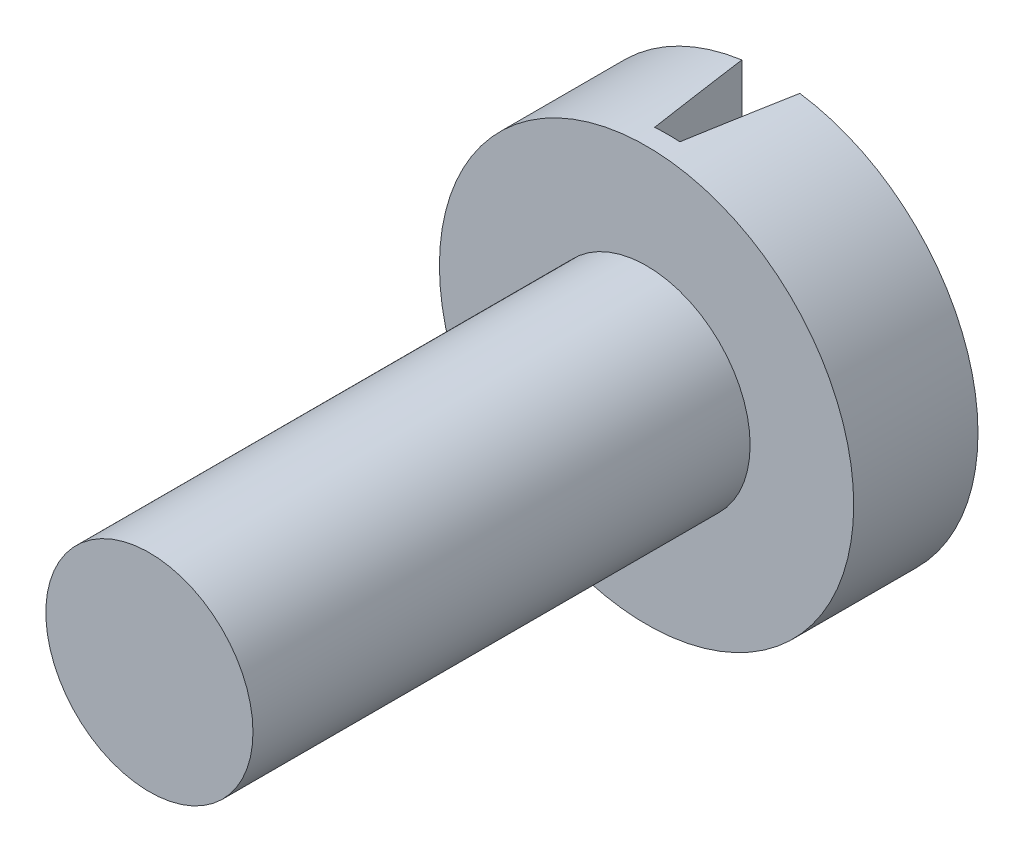
ISO-10303-21;
HEADER;
FILE_DESCRIPTION(('STEP AP214'),'2;1');
FILE_NAME('part.step','',(''),(''),'','','');
FILE_SCHEMA(('AUTOMOTIVE_DESIGN { 1 0 10303 214 1 1 1 1 }'));
ENDSEC;
DATA;
#1=APPLICATION_CONTEXT('core data for automotive mechanical design processes');
#2=APPLICATION_PROTOCOL_DEFINITION('international standard','automotive_design',2000,#1);
#3=PRODUCT_CONTEXT('',#1,'mechanical');
#4=PRODUCT('Part','Part','',(#3));
#5=PRODUCT_RELATED_PRODUCT_CATEGORY('part','',(#4));
#6=PRODUCT_DEFINITION_FORMATION('','',#4);
#7=PRODUCT_DEFINITION_CONTEXT('part definition',#1,'design');
#8=PRODUCT_DEFINITION('design','',#6,#7);
#9=PRODUCT_DEFINITION_SHAPE('','',#8);
#10=(LENGTH_UNIT() NAMED_UNIT(*) SI_UNIT(.MILLI.,.METRE.));
#11=(NAMED_UNIT(*) PLANE_ANGLE_UNIT() SI_UNIT($,.RADIAN.));
#12=(NAMED_UNIT(*) SI_UNIT($,.STERADIAN.) SOLID_ANGLE_UNIT());
#13=UNCERTAINTY_MEASURE_WITH_UNIT(LENGTH_MEASURE(1.E-05),#10,'distance_accuracy_value','');
#14=(GEOMETRIC_REPRESENTATION_CONTEXT(3) GLOBAL_UNCERTAINTY_ASSIGNED_CONTEXT((#13)) GLOBAL_UNIT_ASSIGNED_CONTEXT((#10,
#11,#12)) REPRESENTATION_CONTEXT('',''));
#15=CARTESIAN_POINT('',(0.,0.,0.));
#16=DIRECTION('',(0.,0.,1.));
#17=DIRECTION('',(1.,0.,0.));
#18=AXIS2_PLACEMENT_3D('',#15,#16,#17);
#19=CARTESIAN_POINT('',(0.,0.,-3.));
#20=DIRECTION('',(0.,0.,1.));
#21=DIRECTION('',(1.,0.,0.));
#22=AXIS2_PLACEMENT_3D('',#19,#20,#21);
#23=PLANE('',#22);
#24=CARTESIAN_POINT('',(0.,0.,-3.));
#25=DIRECTION('',(0.,0.,1.));
#26=DIRECTION('',(1.,0.,0.));
#27=AXIS2_PLACEMENT_3D('',#24,#25,#26);
#28=CIRCLE('',#27,5.);
#29=CARTESIAN_POINT('',(-0.7,4.95075751779463,-3.));
#30=VERTEX_POINT('',#29);
#31=CARTESIAN_POINT('',(-0.7,-4.95075751779463,-3.));
#32=VERTEX_POINT('',#31);
#33=EDGE_CURVE('E102',#30,#32,#28,.T.);
#34=ORIENTED_EDGE('',*,*,#33,.F.);
#35=DIRECTION('',(0.,-1.,0.));
#36=VECTOR('',#35,1.);
#37=CARTESIAN_POINT('',(-0.7,0.,-3.));
#38=LINE('',#37,#36);
#39=EDGE_CURVE('E88',#30,#32,#38,.T.);
#40=ORIENTED_EDGE('',*,*,#39,.T.);
#41=EDGE_LOOP('',(#34,#40));
#42=FACE_BOUND('',#41,.T.);
#43=ADVANCED_FACE('F39',(#42),#23,.F.);
#44=CARTESIAN_POINT('',(0.,0.,12.));
#45=DIRECTION('',(0.,0.,-1.));
#46=DIRECTION('',(-1.,0.,0.));
#47=AXIS2_PLACEMENT_3D('',#44,#45,#46);
#48=CYLINDRICAL_SURFACE('',#47,2.5);
#49=CARTESIAN_POINT('',(0.,0.,12.));
#50=DIRECTION('',(0.,0.,1.));
#51=DIRECTION('',(1.,0.,0.));
#52=AXIS2_PLACEMENT_3D('',#49,#50,#51);
#53=CIRCLE('',#52,2.5);
#54=CARTESIAN_POINT('',(2.5,0.,12.));
#55=VERTEX_POINT('',#54);
#56=EDGE_CURVE('E89',#55,#55,#53,.T.);
#57=ORIENTED_EDGE('',*,*,#56,.F.);
#58=EDGE_LOOP('',(#57));
#59=FACE_BOUND('',#58,.T.);
#60=CARTESIAN_POINT('',(0.,0.,0.));
#61=DIRECTION('',(0.,0.,1.));
#62=DIRECTION('',(1.,0.,0.));
#63=AXIS2_PLACEMENT_3D('',#60,#61,#62);
#64=CIRCLE('',#63,2.5);
#65=CARTESIAN_POINT('',(2.5,0.,0.));
#66=VERTEX_POINT('',#65);
#67=EDGE_CURVE('E108',#66,#66,#64,.T.);
#68=ORIENTED_EDGE('',*,*,#67,.T.);
#69=EDGE_LOOP('',(#68));
#70=FACE_BOUND('',#69,.T.);
#71=ADVANCED_FACE('F41',(#59,#70),#48,.T.);
#72=CARTESIAN_POINT('',(0.,0.,12.));
#73=DIRECTION('',(0.,0.,1.));
#74=DIRECTION('',(1.,0.,0.));
#75=AXIS2_PLACEMENT_3D('',#72,#73,#74);
#76=PLANE('',#75);
#77=ORIENTED_EDGE('',*,*,#56,.T.);
#78=EDGE_LOOP('',(#77));
#79=FACE_BOUND('',#78,.T.);
#80=ADVANCED_FACE('F141',(#79),#76,.T.);
#81=CARTESIAN_POINT('',(0.,0.,-3.));
#82=DIRECTION('',(0.,0.,1.));
#83=DIRECTION('',(1.,0.,0.));
#84=AXIS2_PLACEMENT_3D('',#81,#82,#83);
#85=CYLINDRICAL_SURFACE('',#84,5.);
#86=CARTESIAN_POINT('',(0.,0.,1.41962606027253));
#87=DIRECTION('',(-0.987688340595138,0.,0.156434465040231));
#88=DIRECTION('',(0.156434465040231,0.,0.987688340595138));
#89=AXIS2_PLACEMENT_3D('',#86,#87,#88);
#90=ELLIPSE('',#89,31.9622661074983,5.);
#91=CARTESIAN_POINT('',(-0.304038899188659,-4.99074747385401,-0.5));
#92=VERTEX_POINT('',#91);
#93=EDGE_CURVE('E110',#92,#32,#90,.F.);
#94=ORIENTED_EDGE('',*,*,#93,.F.);
#95=CARTESIAN_POINT('',(0.,0.,-0.5));
#96=DIRECTION('',(0.,0.,1.));
#97=DIRECTION('',(1.,0.,0.));
#98=AXIS2_PLACEMENT_3D('',#95,#96,#97);
#99=CIRCLE('',#98,5.);
#100=CARTESIAN_POINT('',(0.304038899188659,-4.99074747385401,-0.5));
#101=VERTEX_POINT('',#100);
#102=EDGE_CURVE('E11',#101,#92,#99,.F.);
#103=ORIENTED_EDGE('',*,*,#102,.F.);
#104=CARTESIAN_POINT('',(0.,0.,1.41962606027253));
#105=DIRECTION('',(0.987688340595138,0.,0.156434465040231));
#106=DIRECTION('',(-0.156434465040231,0.,0.987688340595138));
#107=AXIS2_PLACEMENT_3D('',#104,#105,#106);
#108=ELLIPSE('',#107,31.9622661074983,5.);
#109=CARTESIAN_POINT('',(0.7,-4.95075751779463,-3.));
#110=VERTEX_POINT('',#109);
#111=EDGE_CURVE('E82',#110,#101,#108,.F.);
#112=ORIENTED_EDGE('',*,*,#111,.F.);
#113=CARTESIAN_POINT('',(0.7,4.95075751779463,-3.));
#114=VERTEX_POINT('',#113);
#115=EDGE_CURVE('E96',#110,#114,#28,.T.);
#116=ORIENTED_EDGE('',*,*,#115,.T.);
#117=CARTESIAN_POINT('',(0.304038899188659,4.99074747385401,-0.5));
#118=VERTEX_POINT('',#117);
#119=EDGE_CURVE('E55',#118,#114,#108,.F.);
#120=ORIENTED_EDGE('',*,*,#119,.F.);
#121=CARTESIAN_POINT('',(-0.304038899188659,4.99074747385401,-0.5));
#122=VERTEX_POINT('',#121);
#123=EDGE_CURVE('E43',#122,#118,#99,.F.);
#124=ORIENTED_EDGE('',*,*,#123,.F.);
#125=EDGE_CURVE('E63',#30,#122,#90,.F.);
#126=ORIENTED_EDGE('',*,*,#125,.F.);
#127=ORIENTED_EDGE('',*,*,#33,.T.);
#128=EDGE_LOOP('',(#94,#103,#112,#116,#120,#124,#126,#127));
#129=FACE_BOUND('',#128,.T.);
#130=CARTESIAN_POINT('',(0.,0.,0.));
#131=DIRECTION('',(0.,0.,1.));
#132=DIRECTION('',(1.,0.,0.));
#133=AXIS2_PLACEMENT_3D('',#130,#131,#132);
#134=CIRCLE('',#133,5.);
#135=CARTESIAN_POINT('',(5.,0.,0.));
#136=VERTEX_POINT('',#135);
#137=EDGE_CURVE('E103',#136,#136,#134,.T.);
#138=ORIENTED_EDGE('',*,*,#137,.F.);
#139=EDGE_LOOP('',(#138));
#140=FACE_BOUND('',#139,.T.);
#141=ADVANCED_FACE('F94',(#129,#140),#85,.T.);
#142=ORIENTED_EDGE('',*,*,#115,.F.);
#143=DIRECTION('',(0.,1.,0.));
#144=VECTOR('',#143,1.);
#145=CARTESIAN_POINT('',(0.7,0.,-3.));
#146=LINE('',#145,#144);
#147=EDGE_CURVE('E79',#110,#114,#146,.T.);
#148=ORIENTED_EDGE('',*,*,#147,.T.);
#149=EDGE_LOOP('',(#142,#148));
#150=FACE_BOUND('',#149,.T.);
#151=ADVANCED_FACE('F100',(#150),#23,.F.);
#152=CARTESIAN_POINT('',(0.,0.,0.));
#153=DIRECTION('',(0.,0.,1.));
#154=DIRECTION('',(1.,0.,0.));
#155=AXIS2_PLACEMENT_3D('',#152,#153,#154);
#156=PLANE('',#155);
#157=ORIENTED_EDGE('',*,*,#67,.F.);
#158=EDGE_LOOP('',(#157));
#159=FACE_BOUND('',#158,.T.);
#160=ORIENTED_EDGE('',*,*,#137,.T.);
#161=EDGE_LOOP('',(#160));
#162=FACE_BOUND('',#161,.T.);
#163=ADVANCED_FACE('F146',(#159,#162),#156,.T.);
#164=CARTESIAN_POINT('',(-0.7,-5.5,-3.));
#165=DIRECTION('',(-0.987688340595138,0.,0.156434465040231));
#166=DIRECTION('',(0.156434465040231,0.,0.987688340595138));
#167=AXIS2_PLACEMENT_3D('',#164,#165,#166);
#168=PLANE('',#167);
#169=ORIENTED_EDGE('',*,*,#93,.T.);
#170=ORIENTED_EDGE('',*,*,#39,.F.);
#171=ORIENTED_EDGE('',*,*,#125,.T.);
#172=DIRECTION('',(0.,1.,0.));
#173=VECTOR('',#172,1.);
#174=CARTESIAN_POINT('',(-0.304038899188659,-5.5,-0.5));
#175=LINE('',#174,#173);
#176=EDGE_CURVE('E127',#92,#122,#175,.T.);
#177=ORIENTED_EDGE('',*,*,#176,.F.);
#178=EDGE_LOOP('',(#169,#170,#171,#177));
#179=FACE_BOUND('',#178,.T.);
#180=ADVANCED_FACE('F135',(#179),#168,.F.);
#181=CARTESIAN_POINT('',(0.7,-5.5,-3.));
#182=DIRECTION('',(0.987688340595138,0.,0.156434465040231));
#183=DIRECTION('',(0.156434465040231,0.,-0.987688340595138));
#184=AXIS2_PLACEMENT_3D('',#181,#182,#183);
#185=PLANE('',#184);
#186=ORIENTED_EDGE('',*,*,#119,.T.);
#187=ORIENTED_EDGE('',*,*,#147,.F.);
#188=ORIENTED_EDGE('',*,*,#111,.T.);
#189=DIRECTION('',(0.,-1.,0.));
#190=VECTOR('',#189,1.);
#191=CARTESIAN_POINT('',(0.304038899188659,-5.5,-0.5));
#192=LINE('',#191,#190);
#193=EDGE_CURVE('E98',#118,#101,#192,.T.);
#194=ORIENTED_EDGE('',*,*,#193,.F.);
#195=EDGE_LOOP('',(#186,#187,#188,#194));
#196=FACE_BOUND('',#195,.T.);
#197=ADVANCED_FACE('F81',(#196),#185,.F.);
#198=CARTESIAN_POINT('',(0.,0.,-0.5));
#199=DIRECTION('',(0.,0.,1.));
#200=DIRECTION('',(1.,0.,0.));
#201=AXIS2_PLACEMENT_3D('',#198,#199,#200);
#202=PLANE('',#201);
#203=ORIENTED_EDGE('',*,*,#102,.T.);
#204=ORIENTED_EDGE('',*,*,#176,.T.);
#205=ORIENTED_EDGE('',*,*,#123,.T.);
#206=ORIENTED_EDGE('',*,*,#193,.T.);
#207=EDGE_LOOP('',(#203,#204,#205,#206));
#208=FACE_BOUND('',#207,.T.);
#209=ADVANCED_FACE('F126',(#208),#202,.F.);
#210=CLOSED_SHELL('',(#43,#71,#80,#141,#151,#163,#180,#197,#209));
#211=MANIFOLD_SOLID_BREP('B2',#210);
#212=ADVANCED_BREP_SHAPE_REPRESENTATION('',(#18,#211),#14);
#213=SHAPE_DEFINITION_REPRESENTATION(#9,#212);
ENDSEC;
END-ISO-10303-21;
